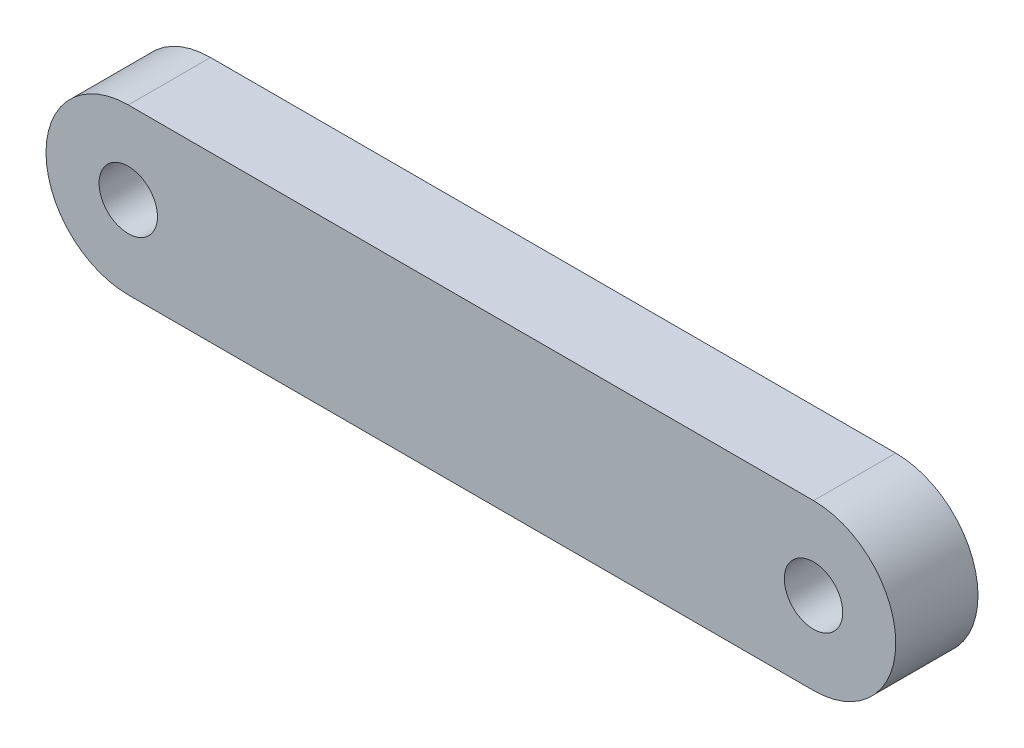
ISO-10303-21;
HEADER;
FILE_DESCRIPTION(('STEP AP214'),'2;1');
FILE_NAME('part.step','',(''),(''),'','','');
FILE_SCHEMA(('AUTOMOTIVE_DESIGN { 1 0 10303 214 1 1 1 1 }'));
ENDSEC;
DATA;
#1=APPLICATION_CONTEXT('core data for automotive mechanical design processes');
#2=APPLICATION_PROTOCOL_DEFINITION('international standard','automotive_design',2000,#1);
#3=PRODUCT_CONTEXT('',#1,'mechanical');
#4=PRODUCT('Part','Part','',(#3));
#5=PRODUCT_RELATED_PRODUCT_CATEGORY('part','',(#4));
#6=PRODUCT_DEFINITION_FORMATION('','',#4);
#7=PRODUCT_DEFINITION_CONTEXT('part definition',#1,'design');
#8=PRODUCT_DEFINITION('design','',#6,#7);
#9=PRODUCT_DEFINITION_SHAPE('','',#8);
#10=(LENGTH_UNIT() NAMED_UNIT(*) SI_UNIT(.MILLI.,.METRE.));
#11=(NAMED_UNIT(*) PLANE_ANGLE_UNIT() SI_UNIT($,.RADIAN.));
#12=(NAMED_UNIT(*) SI_UNIT($,.STERADIAN.) SOLID_ANGLE_UNIT());
#13=UNCERTAINTY_MEASURE_WITH_UNIT(LENGTH_MEASURE(1.E-05),#10,'distance_accuracy_value','');
#14=(GEOMETRIC_REPRESENTATION_CONTEXT(3) GLOBAL_UNCERTAINTY_ASSIGNED_CONTEXT((#13)) GLOBAL_UNIT_ASSIGNED_CONTEXT((#10,
#11,#12)) REPRESENTATION_CONTEXT('',''));
#15=CARTESIAN_POINT('',(0.,0.,0.));
#16=DIRECTION('',(0.,0.,1.));
#17=DIRECTION('',(1.,0.,0.));
#18=AXIS2_PLACEMENT_3D('',#15,#16,#17);
#19=CARTESIAN_POINT('',(-10.415,0.,2.5));
#20=DIRECTION('',(0.,0.,1.));
#21=DIRECTION('',(1.,0.,0.));
#22=AXIS2_PLACEMENT_3D('',#19,#20,#21);
#23=PLANE('',#22);
#24=CARTESIAN_POINT('',(-10.415,0.,2.5));
#25=DIRECTION('',(0.,0.,1.));
#26=DIRECTION('',(1.,0.,0.));
#27=AXIS2_PLACEMENT_3D('',#24,#25,#26);
#28=CIRCLE('',#27,0.887499999999999);
#29=CARTESIAN_POINT('',(-9.5275,0.,2.5));
#30=VERTEX_POINT('',#29);
#31=EDGE_CURVE('E118',#30,#30,#28,.T.);
#32=ORIENTED_EDGE('',*,*,#31,.F.);
#33=EDGE_LOOP('',(#32));
#34=FACE_BOUND('',#33,.T.);
#35=CARTESIAN_POINT('',(-10.415,0.,2.5));
#36=DIRECTION('',(0.,0.,1.));
#37=DIRECTION('',(1.,0.,0.));
#38=AXIS2_PLACEMENT_3D('',#35,#36,#37);
#39=CIRCLE('',#38,2.5);
#40=CARTESIAN_POINT('',(-10.415,2.5,2.5));
#41=VERTEX_POINT('',#40);
#42=CARTESIAN_POINT('',(-10.415,-2.5,2.5));
#43=VERTEX_POINT('',#42);
#44=EDGE_CURVE('E98',#41,#43,#39,.T.);
#45=ORIENTED_EDGE('',*,*,#44,.T.);
#46=DIRECTION('',(1.,0.,0.));
#47=VECTOR('',#46,1.);
#48=CARTESIAN_POINT('',(-10.415,-2.5,2.5));
#49=LINE('',#48,#47);
#50=CARTESIAN_POINT('',(10.415,-2.5,2.5));
#51=VERTEX_POINT('',#50);
#52=EDGE_CURVE('E93',#43,#51,#49,.T.);
#53=ORIENTED_EDGE('',*,*,#52,.T.);
#54=CARTESIAN_POINT('',(10.415,0.,2.5));
#55=DIRECTION('',(0.,0.,1.));
#56=DIRECTION('',(1.,0.,0.));
#57=AXIS2_PLACEMENT_3D('',#54,#55,#56);
#58=CIRCLE('',#57,2.5);
#59=CARTESIAN_POINT('',(10.415,2.5,2.5));
#60=VERTEX_POINT('',#59);
#61=EDGE_CURVE('E96',#51,#60,#58,.T.);
#62=ORIENTED_EDGE('',*,*,#61,.T.);
#63=DIRECTION('',(-1.,0.,0.));
#64=VECTOR('',#63,1.);
#65=CARTESIAN_POINT('',(-10.415,2.5,2.5));
#66=LINE('',#65,#64);
#67=EDGE_CURVE('E63',#60,#41,#66,.T.);
#68=ORIENTED_EDGE('',*,*,#67,.T.);
#69=EDGE_LOOP('',(#45,#53,#62,#68));
#70=FACE_BOUND('',#69,.T.);
#71=CARTESIAN_POINT('',(10.415,0.,2.5));
#72=DIRECTION('',(0.,0.,1.));
#73=DIRECTION('',(1.,0.,0.));
#74=AXIS2_PLACEMENT_3D('',#71,#72,#73);
#75=CIRCLE('',#74,0.887499999999999);
#76=CARTESIAN_POINT('',(11.3025,0.,2.5));
#77=VERTEX_POINT('',#76);
#78=EDGE_CURVE('E140',#77,#77,#75,.T.);
#79=ORIENTED_EDGE('',*,*,#78,.F.);
#80=EDGE_LOOP('',(#79));
#81=FACE_BOUND('',#80,.T.);
#82=ADVANCED_FACE('F45',(#34,#70,#81),#23,.T.);
#83=CARTESIAN_POINT('',(-10.415,0.,0.));
#84=DIRECTION('',(0.,0.,1.));
#85=DIRECTION('',(1.,0.,0.));
#86=AXIS2_PLACEMENT_3D('',#83,#84,#85);
#87=PLANE('',#86);
#88=CARTESIAN_POINT('',(-10.415,0.,0.));
#89=DIRECTION('',(0.,0.,1.));
#90=DIRECTION('',(1.,0.,0.));
#91=AXIS2_PLACEMENT_3D('',#88,#89,#90);
#92=CIRCLE('',#91,2.5);
#93=CARTESIAN_POINT('',(-10.415,2.5,0.));
#94=VERTEX_POINT('',#93);
#95=CARTESIAN_POINT('',(-10.415,-2.5,0.));
#96=VERTEX_POINT('',#95);
#97=EDGE_CURVE('E114',#94,#96,#92,.T.);
#98=ORIENTED_EDGE('',*,*,#97,.F.);
#99=DIRECTION('',(-1.,0.,0.));
#100=VECTOR('',#99,1.);
#101=CARTESIAN_POINT('',(-10.415,2.5,0.));
#102=LINE('',#101,#100);
#103=CARTESIAN_POINT('',(10.415,2.5,0.));
#104=VERTEX_POINT('',#103);
#105=EDGE_CURVE('E86',#104,#94,#102,.T.);
#106=ORIENTED_EDGE('',*,*,#105,.F.);
#107=CARTESIAN_POINT('',(10.415,0.,0.));
#108=DIRECTION('',(0.,0.,1.));
#109=DIRECTION('',(1.,0.,0.));
#110=AXIS2_PLACEMENT_3D('',#107,#108,#109);
#111=CIRCLE('',#110,2.5);
#112=CARTESIAN_POINT('',(10.415,-2.5,0.));
#113=VERTEX_POINT('',#112);
#114=EDGE_CURVE('E80',#113,#104,#111,.T.);
#115=ORIENTED_EDGE('',*,*,#114,.F.);
#116=DIRECTION('',(1.,0.,0.));
#117=VECTOR('',#116,1.);
#118=CARTESIAN_POINT('',(-10.415,-2.5,0.));
#119=LINE('',#118,#117);
#120=EDGE_CURVE('E103',#96,#113,#119,.T.);
#121=ORIENTED_EDGE('',*,*,#120,.F.);
#122=EDGE_LOOP('',(#98,#106,#115,#121));
#123=FACE_BOUND('',#122,.T.);
#124=CARTESIAN_POINT('',(-10.415,0.,0.));
#125=DIRECTION('',(0.,0.,1.));
#126=DIRECTION('',(1.,0.,0.));
#127=AXIS2_PLACEMENT_3D('',#124,#125,#126);
#128=CIRCLE('',#127,0.887499999999999);
#129=CARTESIAN_POINT('',(-9.5275,0.,0.));
#130=VERTEX_POINT('',#129);
#131=EDGE_CURVE('E136',#130,#130,#128,.T.);
#132=ORIENTED_EDGE('',*,*,#131,.T.);
#133=EDGE_LOOP('',(#132));
#134=FACE_BOUND('',#133,.T.);
#135=CARTESIAN_POINT('',(10.415,0.,0.));
#136=DIRECTION('',(0.,0.,1.));
#137=DIRECTION('',(1.,0.,0.));
#138=AXIS2_PLACEMENT_3D('',#135,#136,#137);
#139=CIRCLE('',#138,0.887499999999999);
#140=CARTESIAN_POINT('',(11.3025,0.,0.));
#141=VERTEX_POINT('',#140);
#142=EDGE_CURVE('E144',#141,#141,#139,.T.);
#143=ORIENTED_EDGE('',*,*,#142,.T.);
#144=EDGE_LOOP('',(#143));
#145=FACE_BOUND('',#144,.T.);
#146=ADVANCED_FACE('F131',(#123,#134,#145),#87,.F.);
#147=CARTESIAN_POINT('',(-10.415,0.,2.5));
#148=DIRECTION('',(0.,0.,-1.));
#149=DIRECTION('',(-1.,0.,0.));
#150=AXIS2_PLACEMENT_3D('',#147,#148,#149);
#151=CYLINDRICAL_SURFACE('',#150,2.5);
#152=ORIENTED_EDGE('',*,*,#97,.T.);
#153=DIRECTION('',(0.,0.,-1.));
#154=VECTOR('',#153,1.);
#155=CARTESIAN_POINT('',(-10.415,-2.5,2.5));
#156=LINE('',#155,#154);
#157=EDGE_CURVE('E11',#43,#96,#156,.T.);
#158=ORIENTED_EDGE('',*,*,#157,.F.);
#159=ORIENTED_EDGE('',*,*,#44,.F.);
#160=DIRECTION('',(0.,0.,-1.));
#161=VECTOR('',#160,1.);
#162=CARTESIAN_POINT('',(-10.415,2.5,2.5));
#163=LINE('',#162,#161);
#164=EDGE_CURVE('E110',#41,#94,#163,.T.);
#165=ORIENTED_EDGE('',*,*,#164,.T.);
#166=EDGE_LOOP('',(#152,#158,#159,#165));
#167=FACE_BOUND('',#166,.T.);
#168=ADVANCED_FACE('F47',(#167),#151,.T.);
#169=CARTESIAN_POINT('',(-10.415,-2.5,2.5));
#170=DIRECTION('',(0.,1.,0.));
#171=DIRECTION('',(-1.,0.,0.));
#172=AXIS2_PLACEMENT_3D('',#169,#170,#171);
#173=PLANE('',#172);
#174=ORIENTED_EDGE('',*,*,#120,.T.);
#175=DIRECTION('',(0.,0.,-1.));
#176=VECTOR('',#175,1.);
#177=CARTESIAN_POINT('',(10.415,-2.5,2.5));
#178=LINE('',#177,#176);
#179=EDGE_CURVE('E55',#51,#113,#178,.T.);
#180=ORIENTED_EDGE('',*,*,#179,.F.);
#181=ORIENTED_EDGE('',*,*,#52,.F.);
#182=ORIENTED_EDGE('',*,*,#157,.T.);
#183=EDGE_LOOP('',(#174,#180,#181,#182));
#184=FACE_BOUND('',#183,.T.);
#185=ADVANCED_FACE('F102',(#184),#173,.F.);
#186=CARTESIAN_POINT('',(10.415,0.,2.5));
#187=DIRECTION('',(0.,0.,-1.));
#188=DIRECTION('',(-1.,0.,0.));
#189=AXIS2_PLACEMENT_3D('',#186,#187,#188);
#190=CYLINDRICAL_SURFACE('',#189,2.5);
#191=ORIENTED_EDGE('',*,*,#114,.T.);
#192=DIRECTION('',(0.,0.,-1.));
#193=VECTOR('',#192,1.);
#194=CARTESIAN_POINT('',(10.415,2.5,2.5));
#195=LINE('',#194,#193);
#196=EDGE_CURVE('E105',#60,#104,#195,.T.);
#197=ORIENTED_EDGE('',*,*,#196,.F.);
#198=ORIENTED_EDGE('',*,*,#61,.F.);
#199=ORIENTED_EDGE('',*,*,#179,.T.);
#200=EDGE_LOOP('',(#191,#197,#198,#199));
#201=FACE_BOUND('',#200,.T.);
#202=ADVANCED_FACE('F106',(#201),#190,.T.);
#203=CARTESIAN_POINT('',(-10.415,2.5,2.5));
#204=DIRECTION('',(0.,-1.,0.));
#205=DIRECTION('',(1.,0.,0.));
#206=AXIS2_PLACEMENT_3D('',#203,#204,#205);
#207=PLANE('',#206);
#208=ORIENTED_EDGE('',*,*,#105,.T.);
#209=ORIENTED_EDGE('',*,*,#164,.F.);
#210=ORIENTED_EDGE('',*,*,#67,.F.);
#211=ORIENTED_EDGE('',*,*,#196,.T.);
#212=EDGE_LOOP('',(#208,#209,#210,#211));
#213=FACE_BOUND('',#212,.T.);
#214=ADVANCED_FACE('F128',(#213),#207,.F.);
#215=CARTESIAN_POINT('',(-10.415,0.,2.5));
#216=DIRECTION('',(0.,0.,-1.));
#217=DIRECTION('',(-1.,0.,0.));
#218=AXIS2_PLACEMENT_3D('',#215,#216,#217);
#219=CYLINDRICAL_SURFACE('',#218,0.887499999999999);
#220=ORIENTED_EDGE('',*,*,#31,.T.);
#221=EDGE_LOOP('',(#220));
#222=FACE_BOUND('',#221,.T.);
#223=ORIENTED_EDGE('',*,*,#131,.F.);
#224=EDGE_LOOP('',(#223));
#225=FACE_BOUND('',#224,.T.);
#226=ADVANCED_FACE('F163',(#222,#225),#219,.F.);
#227=CARTESIAN_POINT('',(10.415,0.,2.5));
#228=DIRECTION('',(0.,0.,-1.));
#229=DIRECTION('',(-1.,0.,0.));
#230=AXIS2_PLACEMENT_3D('',#227,#228,#229);
#231=CYLINDRICAL_SURFACE('',#230,0.887499999999999);
#232=ORIENTED_EDGE('',*,*,#78,.T.);
#233=EDGE_LOOP('',(#232));
#234=FACE_BOUND('',#233,.T.);
#235=ORIENTED_EDGE('',*,*,#142,.F.);
#236=EDGE_LOOP('',(#235));
#237=FACE_BOUND('',#236,.T.);
#238=ADVANCED_FACE('F152',(#234,#237),#231,.F.);
#239=CLOSED_SHELL('',(#82,#146,#168,#185,#202,#214,#226,#238));
#240=MANIFOLD_SOLID_BREP('B2',#239);
#241=ADVANCED_BREP_SHAPE_REPRESENTATION('',(#18,#240),#14);
#242=SHAPE_DEFINITION_REPRESENTATION(#9,#241);
ENDSEC;
END-ISO-10303-21;
